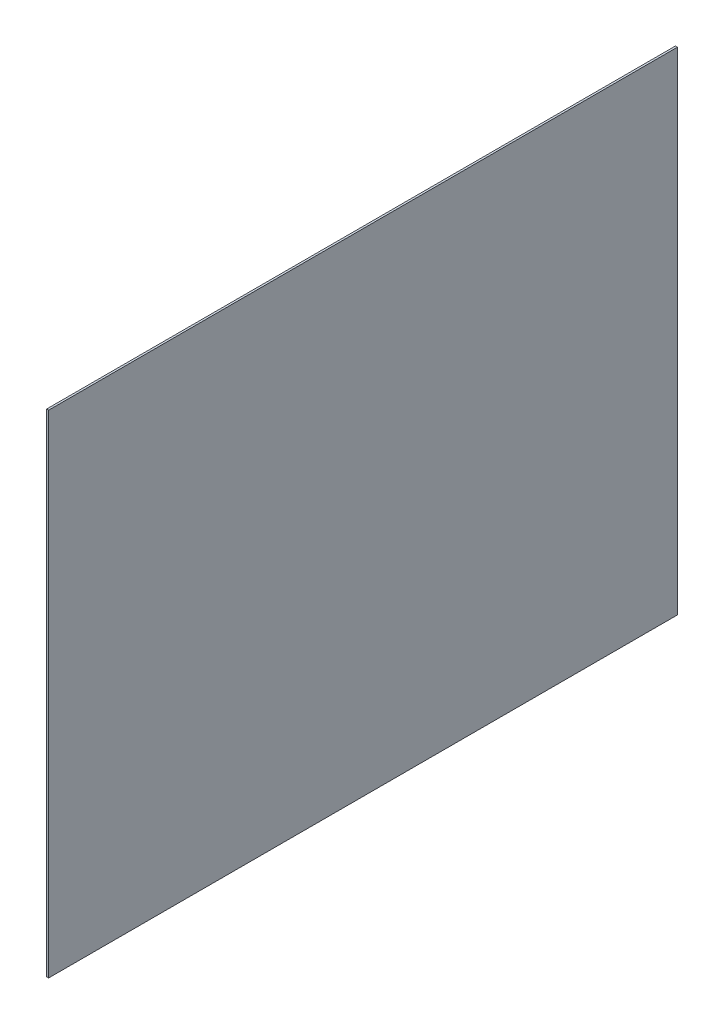
ISO-10303-21;
HEADER;
FILE_DESCRIPTION(('STEP AP214'),'2;1');
FILE_NAME('part.step','',(''),(''),'','','');
FILE_SCHEMA(('AUTOMOTIVE_DESIGN { 1 0 10303 214 1 1 1 1 }'));
ENDSEC;
DATA;
#1=APPLICATION_CONTEXT('core data for automotive mechanical design processes');
#2=APPLICATION_PROTOCOL_DEFINITION('international standard','automotive_design',2000,#1);
#3=PRODUCT_CONTEXT('',#1,'mechanical');
#4=PRODUCT('Part','Part','',(#3));
#5=PRODUCT_RELATED_PRODUCT_CATEGORY('part','',(#4));
#6=PRODUCT_DEFINITION_FORMATION('','',#4);
#7=PRODUCT_DEFINITION_CONTEXT('part definition',#1,'design');
#8=PRODUCT_DEFINITION('design','',#6,#7);
#9=PRODUCT_DEFINITION_SHAPE('','',#8);
#10=(LENGTH_UNIT() NAMED_UNIT(*) SI_UNIT(.MILLI.,.METRE.));
#11=(NAMED_UNIT(*) PLANE_ANGLE_UNIT() SI_UNIT($,.RADIAN.));
#12=(NAMED_UNIT(*) SI_UNIT($,.STERADIAN.) SOLID_ANGLE_UNIT());
#13=UNCERTAINTY_MEASURE_WITH_UNIT(LENGTH_MEASURE(1.E-05),#10,'distance_accuracy_value','');
#14=(GEOMETRIC_REPRESENTATION_CONTEXT(3) GLOBAL_UNCERTAINTY_ASSIGNED_CONTEXT((#13)) GLOBAL_UNIT_ASSIGNED_CONTEXT((#10,
#11,#12)) REPRESENTATION_CONTEXT('',''));
#15=CARTESIAN_POINT('',(0.,0.,0.));
#16=DIRECTION('',(0.,0.,1.));
#17=DIRECTION('',(1.,0.,0.));
#18=AXIS2_PLACEMENT_3D('',#15,#16,#17);
#19=CARTESIAN_POINT('',(25.4,-3098.8,-3962.4));
#20=DIRECTION('',(0.,0.,1.));
#21=DIRECTION('',(1.,0.,0.));
#22=AXIS2_PLACEMENT_3D('',#19,#20,#21);
#23=PLANE('',#22);
#24=DIRECTION('',(0.,1.,0.));
#25=VECTOR('',#24,1.);
#26=CARTESIAN_POINT('',(0.,-3098.8,-3962.4));
#27=LINE('',#26,#25);
#28=CARTESIAN_POINT('',(0.,-3098.8,-3962.4));
#29=VERTEX_POINT('',#28);
#30=CARTESIAN_POINT('',(0.,3098.8,-3962.4));
#31=VERTEX_POINT('',#30);
#32=EDGE_CURVE('E95',#29,#31,#27,.T.);
#33=ORIENTED_EDGE('',*,*,#32,.T.);
#34=DIRECTION('',(-1.,0.,0.));
#35=VECTOR('',#34,1.);
#36=CARTESIAN_POINT('',(25.4,3098.8,-3962.4));
#37=LINE('',#36,#35);
#38=CARTESIAN_POINT('',(25.4,3098.8,-3962.4));
#39=VERTEX_POINT('',#38);
#40=EDGE_CURVE('E11',#39,#31,#37,.T.);
#41=ORIENTED_EDGE('',*,*,#40,.F.);
#42=DIRECTION('',(0.,1.,0.));
#43=VECTOR('',#42,1.);
#44=CARTESIAN_POINT('',(25.4,-3098.8,-3962.4));
#45=LINE('',#44,#43);
#46=CARTESIAN_POINT('',(25.4,-3098.8,-3962.4));
#47=VERTEX_POINT('',#46);
#48=EDGE_CURVE('E83',#47,#39,#45,.T.);
#49=ORIENTED_EDGE('',*,*,#48,.F.);
#50=DIRECTION('',(-1.,0.,0.));
#51=VECTOR('',#50,1.);
#52=CARTESIAN_POINT('',(25.4,-3098.8,-3962.4));
#53=LINE('',#52,#51);
#54=EDGE_CURVE('E91',#47,#29,#53,.T.);
#55=ORIENTED_EDGE('',*,*,#54,.T.);
#56=EDGE_LOOP('',(#33,#41,#49,#55));
#57=FACE_BOUND('',#56,.T.);
#58=ADVANCED_FACE('F32',(#57),#23,.F.);
#59=CARTESIAN_POINT('',(25.4,3098.8,3962.4));
#60=DIRECTION('',(0.,-1.,0.));
#61=DIRECTION('',(0.,0.,-1.));
#62=AXIS2_PLACEMENT_3D('',#59,#60,#61);
#63=PLANE('',#62);
#64=DIRECTION('',(0.,0.,1.));
#65=VECTOR('',#64,1.);
#66=CARTESIAN_POINT('',(0.,3098.8,3962.4));
#67=LINE('',#66,#65);
#68=CARTESIAN_POINT('',(0.,3098.8,3962.4));
#69=VERTEX_POINT('',#68);
#70=EDGE_CURVE('E87',#31,#69,#67,.T.);
#71=ORIENTED_EDGE('',*,*,#70,.T.);
#72=DIRECTION('',(-1.,0.,0.));
#73=VECTOR('',#72,1.);
#74=CARTESIAN_POINT('',(25.4,3098.8,3962.4));
#75=LINE('',#74,#73);
#76=CARTESIAN_POINT('',(25.4,3098.8,3962.4));
#77=VERTEX_POINT('',#76);
#78=EDGE_CURVE('E40',#77,#69,#75,.T.);
#79=ORIENTED_EDGE('',*,*,#78,.F.);
#80=DIRECTION('',(0.,0.,1.));
#81=VECTOR('',#80,1.);
#82=CARTESIAN_POINT('',(25.4,3098.8,3962.4));
#83=LINE('',#82,#81);
#84=EDGE_CURVE('E78',#39,#77,#83,.T.);
#85=ORIENTED_EDGE('',*,*,#84,.F.);
#86=ORIENTED_EDGE('',*,*,#40,.T.);
#87=EDGE_LOOP('',(#71,#79,#85,#86));
#88=FACE_BOUND('',#87,.T.);
#89=ADVANCED_FACE('F86',(#88),#63,.F.);
#90=CARTESIAN_POINT('',(25.4,-3098.8,3962.4));
#91=DIRECTION('',(0.,0.,-1.));
#92=DIRECTION('',(-1.,0.,0.));
#93=AXIS2_PLACEMENT_3D('',#90,#91,#92);
#94=PLANE('',#93);
#95=DIRECTION('',(0.,-1.,0.));
#96=VECTOR('',#95,1.);
#97=CARTESIAN_POINT('',(0.,-3098.8,3962.4));
#98=LINE('',#97,#96);
#99=CARTESIAN_POINT('',(0.,-3098.8,3962.4));
#100=VERTEX_POINT('',#99);
#101=EDGE_CURVE('E65',#69,#100,#98,.T.);
#102=ORIENTED_EDGE('',*,*,#101,.T.);
#103=DIRECTION('',(-1.,0.,0.));
#104=VECTOR('',#103,1.);
#105=CARTESIAN_POINT('',(25.4,-3098.8,3962.4));
#106=LINE('',#105,#104);
#107=CARTESIAN_POINT('',(25.4,-3098.8,3962.4));
#108=VERTEX_POINT('',#107);
#109=EDGE_CURVE('E88',#108,#100,#106,.T.);
#110=ORIENTED_EDGE('',*,*,#109,.F.);
#111=DIRECTION('',(0.,-1.,0.));
#112=VECTOR('',#111,1.);
#113=CARTESIAN_POINT('',(25.4,-3098.8,3962.4));
#114=LINE('',#113,#112);
#115=EDGE_CURVE('E81',#77,#108,#114,.T.);
#116=ORIENTED_EDGE('',*,*,#115,.F.);
#117=ORIENTED_EDGE('',*,*,#78,.T.);
#118=EDGE_LOOP('',(#102,#110,#116,#117));
#119=FACE_BOUND('',#118,.T.);
#120=ADVANCED_FACE('F89',(#119),#94,.F.);
#121=CARTESIAN_POINT('',(25.4,-3098.8,3962.4));
#122=DIRECTION('',(0.,1.,0.));
#123=DIRECTION('',(0.,0.,1.));
#124=AXIS2_PLACEMENT_3D('',#121,#122,#123);
#125=PLANE('',#124);
#126=DIRECTION('',(0.,0.,-1.));
#127=VECTOR('',#126,1.);
#128=CARTESIAN_POINT('',(0.,-3098.8,3962.4));
#129=LINE('',#128,#127);
#130=EDGE_CURVE('E71',#100,#29,#129,.T.);
#131=ORIENTED_EDGE('',*,*,#130,.T.);
#132=ORIENTED_EDGE('',*,*,#54,.F.);
#133=DIRECTION('',(0.,0.,-1.));
#134=VECTOR('',#133,1.);
#135=CARTESIAN_POINT('',(25.4,-3098.8,3962.4));
#136=LINE('',#135,#134);
#137=EDGE_CURVE('E48',#108,#47,#136,.T.);
#138=ORIENTED_EDGE('',*,*,#137,.F.);
#139=ORIENTED_EDGE('',*,*,#109,.T.);
#140=EDGE_LOOP('',(#131,#132,#138,#139));
#141=FACE_BOUND('',#140,.T.);
#142=ADVANCED_FACE('F102',(#141),#125,.F.);
#143=CARTESIAN_POINT('',(25.4,0.,0.));
#144=DIRECTION('',(-1.,0.,0.));
#145=DIRECTION('',(0.,0.,1.));
#146=AXIS2_PLACEMENT_3D('',#143,#144,#145);
#147=PLANE('',#146);
#148=ORIENTED_EDGE('',*,*,#48,.T.);
#149=ORIENTED_EDGE('',*,*,#84,.T.);
#150=ORIENTED_EDGE('',*,*,#115,.T.);
#151=ORIENTED_EDGE('',*,*,#137,.T.);
#152=EDGE_LOOP('',(#148,#149,#150,#151));
#153=FACE_BOUND('',#152,.T.);
#154=ADVANCED_FACE('F79',(#153),#147,.F.);
#155=CARTESIAN_POINT('',(0.,0.,0.));
#156=DIRECTION('',(-1.,0.,0.));
#157=DIRECTION('',(0.,0.,1.));
#158=AXIS2_PLACEMENT_3D('',#155,#156,#157);
#159=PLANE('',#158);
#160=ORIENTED_EDGE('',*,*,#32,.F.);
#161=ORIENTED_EDGE('',*,*,#130,.F.);
#162=ORIENTED_EDGE('',*,*,#101,.F.);
#163=ORIENTED_EDGE('',*,*,#70,.F.);
#164=EDGE_LOOP('',(#160,#161,#162,#163));
#165=FACE_BOUND('',#164,.T.);
#166=ADVANCED_FACE('F105',(#165),#159,.T.);
#167=CLOSED_SHELL('',(#58,#89,#120,#142,#154,#166));
#168=MANIFOLD_SOLID_BREP('B2',#167);
#169=ADVANCED_BREP_SHAPE_REPRESENTATION('',(#18,#168),#14);
#170=SHAPE_DEFINITION_REPRESENTATION(#9,#169);
ENDSEC;
END-ISO-10303-21;
